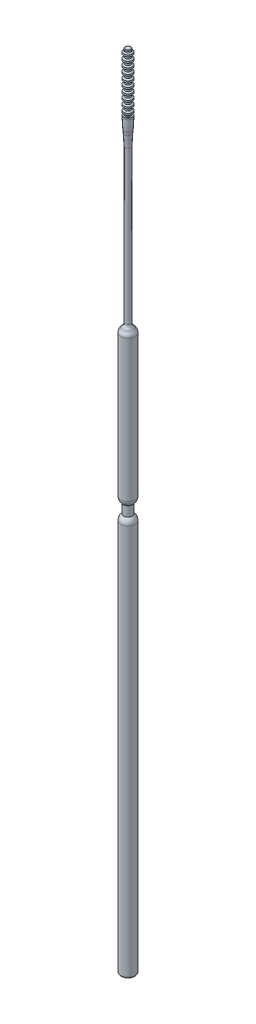
ISO-10303-21;
HEADER;
FILE_DESCRIPTION(('STEP AP214'),'2;1');
FILE_NAME('part.step','',(''),(''),'','','');
FILE_SCHEMA(('AUTOMOTIVE_DESIGN { 1 0 10303 214 1 1 1 1 }'));
ENDSEC;
DATA;
#1=APPLICATION_CONTEXT('core data for automotive mechanical design processes');
#2=APPLICATION_PROTOCOL_DEFINITION('international standard','automotive_design',2000,#1);
#3=PRODUCT_CONTEXT('',#1,'mechanical');
#4=PRODUCT('Part','Part','',(#3));
#5=PRODUCT_RELATED_PRODUCT_CATEGORY('part','',(#4));
#6=PRODUCT_DEFINITION_FORMATION('','',#4);
#7=PRODUCT_DEFINITION_CONTEXT('part definition',#1,'design');
#8=PRODUCT_DEFINITION('design','',#6,#7);
#9=PRODUCT_DEFINITION_SHAPE('','',#8);
#10=(LENGTH_UNIT() NAMED_UNIT(*) SI_UNIT(.MILLI.,.METRE.));
#11=(NAMED_UNIT(*) PLANE_ANGLE_UNIT() SI_UNIT($,.RADIAN.));
#12=(NAMED_UNIT(*) SI_UNIT($,.STERADIAN.) SOLID_ANGLE_UNIT());
#13=UNCERTAINTY_MEASURE_WITH_UNIT(LENGTH_MEASURE(1.E-05),#10,'distance_accuracy_value','');
#14=(GEOMETRIC_REPRESENTATION_CONTEXT(3) GLOBAL_UNCERTAINTY_ASSIGNED_CONTEXT((#13)) GLOBAL_UNIT_ASSIGNED_CONTEXT((#10,
#11,#12)) REPRESENTATION_CONTEXT('',''));
#15=CARTESIAN_POINT('',(0.,0.,0.));
#16=DIRECTION('',(0.,0.,1.));
#17=DIRECTION('',(1.,0.,0.));
#18=AXIS2_PLACEMENT_3D('',#15,#16,#17);
#19=CARTESIAN_POINT('',(0.,11.5,0.));
#20=DIRECTION('',(0.,-1.,0.));
#21=DIRECTION('',(0.,0.,-1.));
#22=AXIS2_PLACEMENT_3D('',#19,#20,#21);
#23=CYLINDRICAL_SURFACE('',#22,0.5);
#24=CARTESIAN_POINT('',(0.,19.1498962308952,0.));
#25=DIRECTION('',(0.,-1.,0.));
#26=DIRECTION('',(1.,0.,0.));
#27=AXIS2_PLACEMENT_3D('',#24,#25,#26);
#28=CIRCLE('',#27,0.5);
#29=CARTESIAN_POINT('',(0.5,19.1498962308952,0.));
#30=VERTEX_POINT('',#29);
#31=EDGE_CURVE('E151',#30,#30,#28,.F.);
#32=ORIENTED_EDGE('',*,*,#31,.T.);
#33=EDGE_LOOP('',(#32));
#34=FACE_BOUND('',#33,.T.);
#35=CARTESIAN_POINT('',(0.,19.8447025837048,0.));
#36=DIRECTION('',(0.,-1.,0.));
#37=DIRECTION('',(1.,0.,0.));
#38=AXIS2_PLACEMENT_3D('',#35,#36,#37);
#39=CIRCLE('',#38,0.5);
#40=CARTESIAN_POINT('',(0.5,19.8447025837048,0.));
#41=VERTEX_POINT('',#40);
#42=EDGE_CURVE('E137',#41,#41,#39,.F.);
#43=ORIENTED_EDGE('',*,*,#42,.F.);
#44=EDGE_LOOP('',(#43));
#45=FACE_BOUND('',#44,.T.);
#46=ADVANCED_FACE('F42',(#34,#45),#23,.T.);
#47=CARTESIAN_POINT('',(0.,18.1498962308952,0.));
#48=DIRECTION('',(0.,-1.,0.));
#49=DIRECTION('',(1.,0.,0.));
#50=AXIS2_PLACEMENT_3D('',#47,#48,#49);
#51=CIRCLE('',#50,0.5);
#52=CARTESIAN_POINT('',(0.5,18.1498962308952,0.));
#53=VERTEX_POINT('',#52);
#54=EDGE_CURVE('E160',#53,#53,#51,.F.);
#55=ORIENTED_EDGE('',*,*,#54,.T.);
#56=EDGE_LOOP('',(#55));
#57=FACE_BOUND('',#56,.T.);
#58=CARTESIAN_POINT('',(0.,18.8447025837048,0.));
#59=DIRECTION('',(0.,-1.,0.));
#60=DIRECTION('',(1.,0.,0.));
#61=AXIS2_PLACEMENT_3D('',#58,#59,#60);
#62=CIRCLE('',#61,0.5);
#63=CARTESIAN_POINT('',(0.5,18.8447025837048,0.));
#64=VERTEX_POINT('',#63);
#65=EDGE_CURVE('E144',#64,#64,#62,.F.);
#66=ORIENTED_EDGE('',*,*,#65,.F.);
#67=EDGE_LOOP('',(#66));
#68=FACE_BOUND('',#67,.T.);
#69=ADVANCED_FACE('F74',(#57,#68),#23,.T.);
#70=CARTESIAN_POINT('',(0.,17.1498962308952,0.));
#71=DIRECTION('',(0.,-1.,0.));
#72=DIRECTION('',(1.,0.,0.));
#73=AXIS2_PLACEMENT_3D('',#70,#71,#72);
#74=CIRCLE('',#73,0.5);
#75=CARTESIAN_POINT('',(0.5,17.1498962308952,0.));
#76=VERTEX_POINT('',#75);
#77=EDGE_CURVE('E170',#76,#76,#74,.F.);
#78=ORIENTED_EDGE('',*,*,#77,.T.);
#79=EDGE_LOOP('',(#78));
#80=FACE_BOUND('',#79,.T.);
#81=CARTESIAN_POINT('',(0.,17.8447025837048,0.));
#82=DIRECTION('',(0.,-1.,0.));
#83=DIRECTION('',(1.,0.,0.));
#84=AXIS2_PLACEMENT_3D('',#81,#82,#83);
#85=CIRCLE('',#84,0.5);
#86=CARTESIAN_POINT('',(0.5,17.8447025837048,0.));
#87=VERTEX_POINT('',#86);
#88=EDGE_CURVE('E159',#87,#87,#85,.F.);
#89=ORIENTED_EDGE('',*,*,#88,.F.);
#90=EDGE_LOOP('',(#89));
#91=FACE_BOUND('',#90,.T.);
#92=ADVANCED_FACE('F79',(#80,#91),#23,.T.);
#93=CARTESIAN_POINT('',(0.,16.1498962308952,0.));
#94=DIRECTION('',(0.,-1.,0.));
#95=DIRECTION('',(1.,0.,0.));
#96=AXIS2_PLACEMENT_3D('',#93,#94,#95);
#97=CIRCLE('',#96,0.5);
#98=CARTESIAN_POINT('',(0.5,16.1498962308952,0.));
#99=VERTEX_POINT('',#98);
#100=EDGE_CURVE('E180',#99,#99,#97,.F.);
#101=ORIENTED_EDGE('',*,*,#100,.T.);
#102=EDGE_LOOP('',(#101));
#103=FACE_BOUND('',#102,.T.);
#104=CARTESIAN_POINT('',(0.,16.8447025837048,0.));
#105=DIRECTION('',(0.,-1.,0.));
#106=DIRECTION('',(1.,0.,0.));
#107=AXIS2_PLACEMENT_3D('',#104,#105,#106);
#108=CIRCLE('',#107,0.5);
#109=CARTESIAN_POINT('',(0.5,16.8447025837048,0.));
#110=VERTEX_POINT('',#109);
#111=EDGE_CURVE('E169',#110,#110,#108,.F.);
#112=ORIENTED_EDGE('',*,*,#111,.F.);
#113=EDGE_LOOP('',(#112));
#114=FACE_BOUND('',#113,.T.);
#115=ADVANCED_FACE('F506',(#103,#114),#23,.T.);
#116=CARTESIAN_POINT('',(0.,15.1498962308952,0.));
#117=DIRECTION('',(0.,-1.,0.));
#118=DIRECTION('',(1.,0.,0.));
#119=AXIS2_PLACEMENT_3D('',#116,#117,#118);
#120=CIRCLE('',#119,0.5);
#121=CARTESIAN_POINT('',(0.5,15.1498962308952,0.));
#122=VERTEX_POINT('',#121);
#123=EDGE_CURVE('E190',#122,#122,#120,.F.);
#124=ORIENTED_EDGE('',*,*,#123,.T.);
#125=EDGE_LOOP('',(#124));
#126=FACE_BOUND('',#125,.T.);
#127=CARTESIAN_POINT('',(0.,15.8447025837048,0.));
#128=DIRECTION('',(0.,-1.,0.));
#129=DIRECTION('',(1.,0.,0.));
#130=AXIS2_PLACEMENT_3D('',#127,#128,#129);
#131=CIRCLE('',#130,0.5);
#132=CARTESIAN_POINT('',(0.5,15.8447025837048,0.));
#133=VERTEX_POINT('',#132);
#134=EDGE_CURVE('E179',#133,#133,#131,.F.);
#135=ORIENTED_EDGE('',*,*,#134,.F.);
#136=EDGE_LOOP('',(#135));
#137=FACE_BOUND('',#136,.T.);
#138=ADVANCED_FACE('F496',(#126,#137),#23,.T.);
#139=CARTESIAN_POINT('',(0.,14.1498962308952,0.));
#140=DIRECTION('',(0.,-1.,0.));
#141=DIRECTION('',(1.,0.,0.));
#142=AXIS2_PLACEMENT_3D('',#139,#140,#141);
#143=CIRCLE('',#142,0.5);
#144=CARTESIAN_POINT('',(0.5,14.1498962308952,0.));
#145=VERTEX_POINT('',#144);
#146=EDGE_CURVE('E200',#145,#145,#143,.F.);
#147=ORIENTED_EDGE('',*,*,#146,.T.);
#148=EDGE_LOOP('',(#147));
#149=FACE_BOUND('',#148,.T.);
#150=CARTESIAN_POINT('',(0.,14.8447025837048,0.));
#151=DIRECTION('',(0.,-1.,0.));
#152=DIRECTION('',(1.,0.,0.));
#153=AXIS2_PLACEMENT_3D('',#150,#151,#152);
#154=CIRCLE('',#153,0.5);
#155=CARTESIAN_POINT('',(0.5,14.8447025837048,0.));
#156=VERTEX_POINT('',#155);
#157=EDGE_CURVE('E189',#156,#156,#154,.F.);
#158=ORIENTED_EDGE('',*,*,#157,.F.);
#159=EDGE_LOOP('',(#158));
#160=FACE_BOUND('',#159,.T.);
#161=ADVANCED_FACE('F491',(#149,#160),#23,.T.);
#162=CARTESIAN_POINT('',(0.,13.1498962308952,0.));
#163=DIRECTION('',(0.,-1.,0.));
#164=DIRECTION('',(1.,0.,0.));
#165=AXIS2_PLACEMENT_3D('',#162,#163,#164);
#166=CIRCLE('',#165,0.5);
#167=CARTESIAN_POINT('',(0.5,13.1498962308952,0.));
#168=VERTEX_POINT('',#167);
#169=EDGE_CURVE('E210',#168,#168,#166,.F.);
#170=ORIENTED_EDGE('',*,*,#169,.T.);
#171=EDGE_LOOP('',(#170));
#172=FACE_BOUND('',#171,.T.);
#173=CARTESIAN_POINT('',(0.,13.8447025837048,0.));
#174=DIRECTION('',(0.,-1.,0.));
#175=DIRECTION('',(1.,0.,0.));
#176=AXIS2_PLACEMENT_3D('',#173,#174,#175);
#177=CIRCLE('',#176,0.5);
#178=CARTESIAN_POINT('',(0.5,13.8447025837048,0.));
#179=VERTEX_POINT('',#178);
#180=EDGE_CURVE('E199',#179,#179,#177,.F.);
#181=ORIENTED_EDGE('',*,*,#180,.F.);
#182=EDGE_LOOP('',(#181));
#183=FACE_BOUND('',#182,.T.);
#184=ADVANCED_FACE('F483',(#172,#183),#23,.T.);
#185=CARTESIAN_POINT('',(0.,12.1498962308952,0.));
#186=DIRECTION('',(0.,-1.,0.));
#187=DIRECTION('',(1.,0.,0.));
#188=AXIS2_PLACEMENT_3D('',#185,#186,#187);
#189=CIRCLE('',#188,0.5);
#190=CARTESIAN_POINT('',(0.5,12.1498962308952,0.));
#191=VERTEX_POINT('',#190);
#192=EDGE_CURVE('E220',#191,#191,#189,.F.);
#193=ORIENTED_EDGE('',*,*,#192,.T.);
#194=EDGE_LOOP('',(#193));
#195=FACE_BOUND('',#194,.T.);
#196=CARTESIAN_POINT('',(0.,12.8447025837048,0.));
#197=DIRECTION('',(0.,-1.,0.));
#198=DIRECTION('',(1.,0.,0.));
#199=AXIS2_PLACEMENT_3D('',#196,#197,#198);
#200=CIRCLE('',#199,0.5);
#201=CARTESIAN_POINT('',(0.5,12.8447025837048,0.));
#202=VERTEX_POINT('',#201);
#203=EDGE_CURVE('E209',#202,#202,#200,.F.);
#204=ORIENTED_EDGE('',*,*,#203,.F.);
#205=EDGE_LOOP('',(#204));
#206=FACE_BOUND('',#205,.T.);
#207=ADVANCED_FACE('F479',(#195,#206),#23,.T.);
#208=CARTESIAN_POINT('',(0.,11.1498962308952,0.));
#209=DIRECTION('',(0.,-1.,0.));
#210=DIRECTION('',(1.,0.,0.));
#211=AXIS2_PLACEMENT_3D('',#208,#209,#210);
#212=CIRCLE('',#211,0.5);
#213=CARTESIAN_POINT('',(0.5,11.1498962308952,0.));
#214=VERTEX_POINT('',#213);
#215=EDGE_CURVE('E259',#214,#214,#212,.F.);
#216=ORIENTED_EDGE('',*,*,#215,.T.);
#217=EDGE_LOOP('',(#216));
#218=FACE_BOUND('',#217,.T.);
#219=CARTESIAN_POINT('',(0.,11.8447025837048,0.));
#220=DIRECTION('',(0.,-1.,0.));
#221=DIRECTION('',(1.,0.,0.));
#222=AXIS2_PLACEMENT_3D('',#219,#220,#221);
#223=CIRCLE('',#222,0.5);
#224=CARTESIAN_POINT('',(0.5,11.8447025837048,0.));
#225=VERTEX_POINT('',#224);
#226=EDGE_CURVE('E219',#225,#225,#223,.F.);
#227=ORIENTED_EDGE('',*,*,#226,.F.);
#228=EDGE_LOOP('',(#227));
#229=FACE_BOUND('',#228,.T.);
#230=ADVANCED_FACE('F482',(#218,#229),#23,.T.);
#231=CARTESIAN_POINT('',(0.,10.25,0.));
#232=DIRECTION('',(0.,1.,0.));
#233=DIRECTION('',(0.,0.,1.));
#234=AXIS2_PLACEMENT_3D('',#231,#232,#233);
#235=CIRCLE('',#234,0.5);
#236=CARTESIAN_POINT('',(0.,10.25,0.5));
#237=VERTEX_POINT('',#236);
#238=EDGE_CURVE('E260',#237,#237,#235,.T.);
#239=ORIENTED_EDGE('',*,*,#238,.T.);
#240=EDGE_LOOP('',(#239));
#241=FACE_BOUND('',#240,.T.);
#242=CARTESIAN_POINT('',(0.,10.8447025837048,0.));
#243=DIRECTION('',(0.,-1.,0.));
#244=DIRECTION('',(1.,0.,0.));
#245=AXIS2_PLACEMENT_3D('',#242,#243,#244);
#246=CIRCLE('',#245,0.5);
#247=CARTESIAN_POINT('',(0.5,10.8447025837048,0.));
#248=VERTEX_POINT('',#247);
#249=EDGE_CURVE('E253',#248,#248,#246,.F.);
#250=ORIENTED_EDGE('',*,*,#249,.F.);
#251=EDGE_LOOP('',(#250));
#252=FACE_BOUND('',#251,.T.);
#253=ADVANCED_FACE('F66',(#241,#252),#23,.T.);
#254=CARTESIAN_POINT('',(0.,5.,0.));
#255=DIRECTION('',(0.,-1.,0.));
#256=DIRECTION('',(0.,0.,-1.));
#257=AXIS2_PLACEMENT_3D('',#254,#255,#256);
#258=CYLINDRICAL_SURFACE('',#257,0.5);
#259=CARTESIAN_POINT('',(0.,-21.5857864376269,0.));
#260=DIRECTION('',(0.,1.,0.));
#261=DIRECTION('',(0.,0.,1.));
#262=AXIS2_PLACEMENT_3D('',#259,#260,#261);
#263=CIRCLE('',#262,0.5);
#264=CARTESIAN_POINT('',(0.,-21.5857864376269,0.5));
#265=VERTEX_POINT('',#264);
#266=EDGE_CURVE('E241',#265,#265,#263,.T.);
#267=ORIENTED_EDGE('',*,*,#266,.T.);
#268=EDGE_LOOP('',(#267));
#269=FACE_BOUND('',#268,.T.);
#270=CARTESIAN_POINT('',(0.,5.50248757758217,0.));
#271=DIRECTION('',(0.,-1.,0.));
#272=DIRECTION('',(0.,0.,-1.));
#273=AXIS2_PLACEMENT_3D('',#270,#271,#272);
#274=CIRCLE('',#273,0.5);
#275=CARTESIAN_POINT('',(0.,5.50248757758217,-0.5));
#276=VERTEX_POINT('',#275);
#277=EDGE_CURVE('E258',#276,#276,#274,.T.);
#278=ORIENTED_EDGE('',*,*,#277,.T.);
#279=EDGE_LOOP('',(#278));
#280=FACE_BOUND('',#279,.T.);
#281=ADVANCED_FACE('F95',(#269,#280),#258,.T.);
#282=CARTESIAN_POINT('',(0.,6.5,0.));
#283=DIRECTION('',(0.,1.,0.));
#284=DIRECTION('',(0.,0.,1.));
#285=AXIS2_PLACEMENT_3D('',#282,#283,#284);
#286=CONICAL_SURFACE('',#285,0.5,0.0996686524911621);
#287=CARTESIAN_POINT('',(0.,7.49256195800216,0.));
#288=DIRECTION('',(0.,-1.,0.));
#289=DIRECTION('',(0.,0.,-1.));
#290=AXIS2_PLACEMENT_3D('',#287,#288,#289);
#291=CIRCLE('',#290,0.599256195800215);
#292=CARTESIAN_POINT('',(0.,7.49256195800216,-0.599256195800215));
#293=VERTEX_POINT('',#292);
#294=EDGE_CURVE('E275',#293,#293,#291,.F.);
#295=ORIENTED_EDGE('',*,*,#294,.T.);
#296=EDGE_LOOP('',(#295));
#297=FACE_BOUND('',#296,.T.);
#298=CARTESIAN_POINT('',(0.,8.00743804199785,0.));
#299=DIRECTION('',(0.,-1.,0.));
#300=DIRECTION('',(0.,0.,-1.));
#301=AXIS2_PLACEMENT_3D('',#298,#299,#300);
#302=CIRCLE('',#301,0.650743804199785);
#303=CARTESIAN_POINT('',(0.,8.00743804199785,-0.650743804199785));
#304=VERTEX_POINT('',#303);
#305=EDGE_CURVE('E279',#304,#304,#302,.T.);
#306=ORIENTED_EDGE('',*,*,#305,.T.);
#307=EDGE_LOOP('',(#306));
#308=FACE_BOUND('',#307,.T.);
#309=ADVANCED_FACE('F91',(#297,#308),#286,.T.);
#310=CARTESIAN_POINT('',(0.,5.,0.));
#311=DIRECTION('',(0.,-1.,0.));
#312=DIRECTION('',(0.,0.,-1.));
#313=AXIS2_PLACEMENT_3D('',#310,#311,#312);
#314=CYLINDRICAL_SURFACE('',#313,0.75);
#315=CARTESIAN_POINT('',(0.,9.99751242241783,0.));
#316=DIRECTION('',(0.,1.,0.));
#317=DIRECTION('',(0.,0.,1.));
#318=AXIS2_PLACEMENT_3D('',#315,#316,#317);
#319=CIRCLE('',#318,0.75);
#320=CARTESIAN_POINT('',(0.,9.99751242241783,0.75));
#321=VERTEX_POINT('',#320);
#322=EDGE_CURVE('E264',#321,#321,#319,.T.);
#323=ORIENTED_EDGE('',*,*,#322,.T.);
#324=EDGE_LOOP('',(#323));
#325=FACE_BOUND('',#324,.T.);
#326=CARTESIAN_POINT('',(0.,10.25,0.));
#327=DIRECTION('',(0.,1.,0.));
#328=DIRECTION('',(0.,0.,1.));
#329=AXIS2_PLACEMENT_3D('',#326,#327,#328);
#330=CIRCLE('',#329,0.75);
#331=CARTESIAN_POINT('',(0.,10.25,0.75));
#332=VERTEX_POINT('',#331);
#333=EDGE_CURVE('E254',#332,#332,#330,.F.);
#334=ORIENTED_EDGE('',*,*,#333,.T.);
#335=EDGE_LOOP('',(#334));
#336=FACE_BOUND('',#335,.T.);
#337=ADVANCED_FACE('F87',(#325,#336),#314,.T.);
#338=CARTESIAN_POINT('',(0.,10.25,0.));
#339=DIRECTION('',(0.,1.,0.));
#340=DIRECTION('',(0.,0.,1.));
#341=AXIS2_PLACEMENT_3D('',#338,#339,#340);
#342=PLANE('',#341);
#343=ORIENTED_EDGE('',*,*,#238,.F.);
#344=EDGE_LOOP('',(#343));
#345=FACE_BOUND('',#344,.T.);
#346=ORIENTED_EDGE('',*,*,#333,.F.);
#347=EDGE_LOOP('',(#346));
#348=FACE_BOUND('',#347,.T.);
#349=ADVANCED_FACE('F90',(#345,#348),#342,.T.);
#350=CARTESIAN_POINT('',(0.,5.50248757758217,0.));
#351=DIRECTION('',(0.,-1.,0.));
#352=DIRECTION('',(0.,0.,-1.));
#353=AXIS2_PLACEMENT_3D('',#350,#351,#352);
#354=TOROIDAL_SURFACE('',#353,20.5,20.);
#355=ORIENTED_EDGE('',*,*,#294,.F.);
#356=EDGE_LOOP('',(#355));
#357=FACE_BOUND('',#356,.T.);
#358=ORIENTED_EDGE('',*,*,#277,.F.);
#359=EDGE_LOOP('',(#358));
#360=FACE_BOUND('',#359,.T.);
#361=ADVANCED_FACE('F100',(#357,#360),#354,.F.);
#362=CARTESIAN_POINT('',(0.,9.99751242241783,0.));
#363=DIRECTION('',(0.,1.,0.));
#364=DIRECTION('',(0.,0.,1.));
#365=AXIS2_PLACEMENT_3D('',#362,#363,#364);
#366=DEGENERATE_TOROIDAL_SURFACE('',#365,19.25,20.,.F.);
#367=ORIENTED_EDGE('',*,*,#322,.F.);
#368=EDGE_LOOP('',(#367));
#369=FACE_BOUND('',#368,.T.);
#370=ORIENTED_EDGE('',*,*,#305,.F.);
#371=EDGE_LOOP('',(#370));
#372=FACE_BOUND('',#371,.T.);
#373=ADVANCED_FACE('F103',(#369,#372),#366,.F.);
#374=CARTESIAN_POINT('',(0.,11.5,0.));
#375=DIRECTION('',(0.,-1.,0.));
#376=DIRECTION('',(1.,0.,0.));
#377=AXIS2_PLACEMENT_3D('',#374,#375,#376);
#378=CONICAL_SURFACE('',#377,0.,0.959931088596889);
#379=CARTESIAN_POINT('',(0.,10.9748443463427,0.));
#380=DIRECTION('',(0.,1.,0.));
#381=DIRECTION('',(-1.,0.,0.));
#382=AXIS2_PLACEMENT_3D('',#379,#380,#381);
#383=CIRCLE('',#382,0.750000000000001);
#384=CARTESIAN_POINT('',(-0.75,10.9748443463427,0.));
#385=VERTEX_POINT('',#384);
#386=EDGE_CURVE('E289',#385,#385,#383,.T.);
#387=ORIENTED_EDGE('',*,*,#386,.T.);
#388=EDGE_LOOP('',(#387));
#389=FACE_BOUND('',#388,.T.);
#390=ORIENTED_EDGE('',*,*,#215,.F.);
#391=EDGE_LOOP('',(#390));
#392=FACE_BOUND('',#391,.T.);
#393=ADVANCED_FACE('F85',(#389,#392),#378,.T.);
#394=CARTESIAN_POINT('',(0.,11.1948063528096,0.));
#395=DIRECTION('',(0.,-1.,0.));
#396=DIRECTION('',(1.,0.,0.));
#397=AXIS2_PLACEMENT_3D('',#394,#395,#396);
#398=CONICAL_SURFACE('',#397,0.,0.959931088596887);
#399=CARTESIAN_POINT('',(0.,10.6696506991524,0.));
#400=DIRECTION('',(0.,1.,0.));
#401=DIRECTION('',(-1.,0.,0.));
#402=AXIS2_PLACEMENT_3D('',#399,#400,#401);
#403=CIRCLE('',#402,0.75);
#404=CARTESIAN_POINT('',(-0.75,10.6696506991524,0.));
#405=VERTEX_POINT('',#404);
#406=EDGE_CURVE('E268',#405,#405,#403,.T.);
#407=ORIENTED_EDGE('',*,*,#406,.F.);
#408=EDGE_LOOP('',(#407));
#409=FACE_BOUND('',#408,.T.);
#410=ORIENTED_EDGE('',*,*,#249,.T.);
#411=EDGE_LOOP('',(#410));
#412=FACE_BOUND('',#411,.T.);
#413=ADVANCED_FACE('F680',(#409,#412),#398,.F.);
#414=CARTESIAN_POINT('',(0.,11.5,0.));
#415=DIRECTION('',(0.,1.,0.));
#416=DIRECTION('',(-1.,0.,0.));
#417=AXIS2_PLACEMENT_3D('',#414,#415,#416);
#418=CYLINDRICAL_SURFACE('',#417,0.75);
#419=ORIENTED_EDGE('',*,*,#386,.F.);
#420=EDGE_LOOP('',(#419));
#421=FACE_BOUND('',#420,.T.);
#422=ORIENTED_EDGE('',*,*,#406,.T.);
#423=EDGE_LOOP('',(#422));
#424=FACE_BOUND('',#423,.T.);
#425=ADVANCED_FACE('F586',(#421,#424),#418,.T.);
#426=CARTESIAN_POINT('',(0.,-21.5,0.));
#427=DIRECTION('',(0.,1.,0.));
#428=DIRECTION('',(0.,0.,1.));
#429=AXIS2_PLACEMENT_3D('',#426,#427,#428);
#430=CYLINDRICAL_SURFACE('',#429,1.25);
#431=CARTESIAN_POINT('',(0.,-23.1642135623731,0.));
#432=DIRECTION('',(0.,-1.,0.));
#433=DIRECTION('',(0.,0.,-1.));
#434=AXIS2_PLACEMENT_3D('',#431,#432,#433);
#435=CIRCLE('',#434,1.25);
#436=CARTESIAN_POINT('',(0.,-23.1642135623731,-1.25));
#437=VERTEX_POINT('',#436);
#438=EDGE_CURVE('E229',#437,#437,#435,.T.);
#439=ORIENTED_EDGE('',*,*,#438,.T.);
#440=EDGE_LOOP('',(#439));
#441=FACE_BOUND('',#440,.T.);
#442=CARTESIAN_POINT('',(0.,-48.25,0.));
#443=DIRECTION('',(0.,1.,0.));
#444=DIRECTION('',(0.,0.,1.));
#445=AXIS2_PLACEMENT_3D('',#442,#443,#444);
#446=CIRCLE('',#445,1.25);
#447=CARTESIAN_POINT('',(0.,-48.25,1.25));
#448=VERTEX_POINT('',#447);
#449=EDGE_CURVE('E293',#448,#448,#446,.T.);
#450=ORIENTED_EDGE('',*,*,#449,.T.);
#451=EDGE_LOOP('',(#450));
#452=FACE_BOUND('',#451,.T.);
#453=ADVANCED_FACE('F580',(#441,#452),#430,.T.);
#454=CARTESIAN_POINT('',(0.,-48.25,0.));
#455=DIRECTION('',(0.,1.,0.));
#456=DIRECTION('',(-1.,0.,0.));
#457=AXIS2_PLACEMENT_3D('',#454,#455,#456);
#458=SPHERICAL_SURFACE('',#457,1.25);
#459=CARTESIAN_POINT('',(0.,-49.25,0.));
#460=DIRECTION('',(0.,1.,0.));
#461=DIRECTION('',(0.,0.,1.));
#462=AXIS2_PLACEMENT_3D('',#459,#460,#461);
#463=CIRCLE('',#462,0.75);
#464=CARTESIAN_POINT('',(0.,-49.25,0.75));
#465=VERTEX_POINT('',#464);
#466=EDGE_CURVE('E297',#465,#465,#463,.T.);
#467=ORIENTED_EDGE('',*,*,#466,.T.);
#468=EDGE_LOOP('',(#467));
#469=FACE_BOUND('',#468,.T.);
#470=ORIENTED_EDGE('',*,*,#449,.F.);
#471=EDGE_LOOP('',(#470));
#472=FACE_BOUND('',#471,.T.);
#473=ADVANCED_FACE('F585',(#469,#472),#458,.T.);
#474=CARTESIAN_POINT('',(0.,-21.5,0.));
#475=DIRECTION('',(0.,1.,0.));
#476=DIRECTION('',(0.,0.,1.));
#477=AXIS2_PLACEMENT_3D('',#474,#475,#476);
#478=CYLINDRICAL_SURFACE('',#477,0.75);
#479=CARTESIAN_POINT('',(0.,-51.,0.));
#480=DIRECTION('',(0.,1.,0.));
#481=DIRECTION('',(0.,0.,1.));
#482=AXIS2_PLACEMENT_3D('',#479,#480,#481);
#483=CIRCLE('',#482,0.75);
#484=CARTESIAN_POINT('',(0.,-51.,0.75));
#485=VERTEX_POINT('',#484);
#486=EDGE_CURVE('E301',#485,#485,#483,.T.);
#487=ORIENTED_EDGE('',*,*,#486,.T.);
#488=EDGE_LOOP('',(#487));
#489=FACE_BOUND('',#488,.T.);
#490=ORIENTED_EDGE('',*,*,#466,.F.);
#491=EDGE_LOOP('',(#490));
#492=FACE_BOUND('',#491,.T.);
#493=ADVANCED_FACE('F632',(#489,#492),#478,.T.);
#494=CARTESIAN_POINT('',(0.,-52.,0.));
#495=DIRECTION('',(0.,1.,0.));
#496=DIRECTION('',(-1.,0.,0.));
#497=AXIS2_PLACEMENT_3D('',#494,#495,#496);
#498=SPHERICAL_SURFACE('',#497,1.25);
#499=CARTESIAN_POINT('',(0.,-52.,0.));
#500=DIRECTION('',(0.,1.,0.));
#501=DIRECTION('',(0.,0.,1.));
#502=AXIS2_PLACEMENT_3D('',#499,#500,#501);
#503=CIRCLE('',#502,1.25);
#504=CARTESIAN_POINT('',(0.,-52.,1.25));
#505=VERTEX_POINT('',#504);
#506=EDGE_CURVE('E224',#505,#505,#503,.T.);
#507=ORIENTED_EDGE('',*,*,#506,.T.);
#508=EDGE_LOOP('',(#507));
#509=FACE_BOUND('',#508,.T.);
#510=ORIENTED_EDGE('',*,*,#486,.F.);
#511=EDGE_LOOP('',(#510));
#512=FACE_BOUND('',#511,.T.);
#513=ADVANCED_FACE('F621',(#509,#512),#498,.T.);
#514=CARTESIAN_POINT('',(0.,-21.5,0.));
#515=DIRECTION('',(0.,1.,0.));
#516=DIRECTION('',(0.,0.,1.));
#517=AXIS2_PLACEMENT_3D('',#514,#515,#516);
#518=CYLINDRICAL_SURFACE('',#517,1.24999999999999);
#519=CARTESIAN_POINT('',(0.,-121.25,0.));
#520=DIRECTION('',(0.,1.,0.));
#521=DIRECTION('',(0.,0.,1.));
#522=AXIS2_PLACEMENT_3D('',#519,#520,#521);
#523=CIRCLE('',#522,1.24999999999999);
#524=CARTESIAN_POINT('',(0.,-121.25,1.24999999999999));
#525=VERTEX_POINT('',#524);
#526=EDGE_CURVE('E249',#525,#525,#523,.T.);
#527=ORIENTED_EDGE('',*,*,#526,.T.);
#528=EDGE_LOOP('',(#527));
#529=FACE_BOUND('',#528,.T.);
#530=ORIENTED_EDGE('',*,*,#506,.F.);
#531=EDGE_LOOP('',(#530));
#532=FACE_BOUND('',#531,.T.);
#533=ADVANCED_FACE('F611',(#529,#532),#518,.T.);
#534=CARTESIAN_POINT('',(0.,-121.5,0.));
#535=DIRECTION('',(0.,1.,0.));
#536=DIRECTION('',(0.,0.,1.));
#537=AXIS2_PLACEMENT_3D('',#534,#535,#536);
#538=PLANE('',#537);
#539=CARTESIAN_POINT('',(0.,-121.5,0.));
#540=DIRECTION('',(0.,1.,0.));
#541=DIRECTION('',(0.,0.,1.));
#542=AXIS2_PLACEMENT_3D('',#539,#540,#541);
#543=CIRCLE('',#542,0.999999999999992);
#544=CARTESIAN_POINT('',(0.,-121.5,0.999999999999992));
#545=VERTEX_POINT('',#544);
#546=EDGE_CURVE('E245',#545,#545,#543,.F.);
#547=ORIENTED_EDGE('',*,*,#546,.T.);
#548=EDGE_LOOP('',(#547));
#549=FACE_BOUND('',#548,.T.);
#550=ADVANCED_FACE('F573',(#549),#538,.F.);
#551=CARTESIAN_POINT('',(0.,-22.,0.));
#552=DIRECTION('',(0.,-1.,0.));
#553=DIRECTION('',(0.,0.,-1.));
#554=AXIS2_PLACEMENT_3D('',#551,#552,#553);
#555=CONICAL_SURFACE('',#554,0.5,0.785398163397448);
#556=CARTESIAN_POINT('',(0.,-22.2928932188135,0.));
#557=DIRECTION('',(0.,1.,0.));
#558=DIRECTION('',(0.,0.,1.));
#559=AXIS2_PLACEMENT_3D('',#556,#557,#558);
#560=CIRCLE('',#559,0.792893218813451);
#561=CARTESIAN_POINT('',(0.,-22.2928932188135,0.792893218813451));
#562=VERTEX_POINT('',#561);
#563=EDGE_CURVE('E233',#562,#562,#560,.F.);
#564=ORIENTED_EDGE('',*,*,#563,.T.);
#565=EDGE_LOOP('',(#564));
#566=FACE_BOUND('',#565,.T.);
#567=CARTESIAN_POINT('',(0.,-22.4571067811865,0.));
#568=DIRECTION('',(0.,1.,0.));
#569=DIRECTION('',(0.,0.,1.));
#570=AXIS2_PLACEMENT_3D('',#567,#568,#569);
#571=CIRCLE('',#570,0.957106781186547);
#572=CARTESIAN_POINT('',(0.,-22.4571067811865,0.957106781186547));
#573=VERTEX_POINT('',#572);
#574=EDGE_CURVE('E237',#573,#573,#571,.T.);
#575=ORIENTED_EDGE('',*,*,#574,.T.);
#576=EDGE_LOOP('',(#575));
#577=FACE_BOUND('',#576,.T.);
#578=ADVANCED_FACE('F115',(#566,#577),#555,.T.);
#579=CARTESIAN_POINT('',(0.,-121.25,0.));
#580=DIRECTION('',(0.,1.,0.));
#581=DIRECTION('',(0.,0.,1.));
#582=AXIS2_PLACEMENT_3D('',#579,#580,#581);
#583=TOROIDAL_SURFACE('',#582,0.999999999999992,0.25);
#584=ORIENTED_EDGE('',*,*,#546,.F.);
#585=EDGE_LOOP('',(#584));
#586=FACE_BOUND('',#585,.T.);
#587=ORIENTED_EDGE('',*,*,#526,.F.);
#588=EDGE_LOOP('',(#587));
#589=FACE_BOUND('',#588,.T.);
#590=ADVANCED_FACE('F111',(#586,#589),#583,.T.);
#591=CARTESIAN_POINT('',(0.,-21.5857864376269,0.));
#592=DIRECTION('',(0.,1.,0.));
#593=DIRECTION('',(0.,0.,1.));
#594=AXIS2_PLACEMENT_3D('',#591,#592,#593);
#595=TOROIDAL_SURFACE('',#594,1.5,1.);
#596=ORIENTED_EDGE('',*,*,#563,.F.);
#597=EDGE_LOOP('',(#596));
#598=FACE_BOUND('',#597,.T.);
#599=ORIENTED_EDGE('',*,*,#266,.F.);
#600=EDGE_LOOP('',(#599));
#601=FACE_BOUND('',#600,.T.);
#602=ADVANCED_FACE('F114',(#598,#601),#595,.F.);
#603=CARTESIAN_POINT('',(0.,-23.1642135623731,0.));
#604=DIRECTION('',(0.,-1.,0.));
#605=DIRECTION('',(0.,0.,-1.));
#606=AXIS2_PLACEMENT_3D('',#603,#604,#605);
#607=DEGENERATE_TOROIDAL_SURFACE('',#606,0.249999999999998,1.,.T.);
#608=ORIENTED_EDGE('',*,*,#438,.F.);
#609=EDGE_LOOP('',(#608));
#610=FACE_BOUND('',#609,.T.);
#611=ORIENTED_EDGE('',*,*,#574,.F.);
#612=EDGE_LOOP('',(#611));
#613=FACE_BOUND('',#612,.T.);
#614=ADVANCED_FACE('F119',(#610,#613),#607,.T.);
#615=CARTESIAN_POINT('',(0.,12.5,0.));
#616=DIRECTION('',(0.,-1.,0.));
#617=DIRECTION('',(1.,0.,0.));
#618=AXIS2_PLACEMENT_3D('',#615,#616,#617);
#619=CONICAL_SURFACE('',#618,0.,0.959931088596889);
#620=CARTESIAN_POINT('',(0.,11.9748443463427,0.));
#621=DIRECTION('',(0.,1.,0.));
#622=DIRECTION('',(-1.,0.,0.));
#623=AXIS2_PLACEMENT_3D('',#620,#621,#622);
#624=CIRCLE('',#623,0.750000000000001);
#625=CARTESIAN_POINT('',(-0.75,11.9748443463427,0.));
#626=VERTEX_POINT('',#625);
#627=EDGE_CURVE('E214',#626,#626,#624,.T.);
#628=ORIENTED_EDGE('',*,*,#627,.T.);
#629=EDGE_LOOP('',(#628));
#630=FACE_BOUND('',#629,.T.);
#631=ORIENTED_EDGE('',*,*,#192,.F.);
#632=EDGE_LOOP('',(#631));
#633=FACE_BOUND('',#632,.T.);
#634=ADVANCED_FACE('F122',(#630,#633),#619,.T.);
#635=CARTESIAN_POINT('',(0.,12.1948063528096,0.));
#636=DIRECTION('',(0.,-1.,0.));
#637=DIRECTION('',(1.,0.,0.));
#638=AXIS2_PLACEMENT_3D('',#635,#636,#637);
#639=CONICAL_SURFACE('',#638,0.,0.959931088596887);
#640=CARTESIAN_POINT('',(0.,11.6696506991524,0.));
#641=DIRECTION('',(0.,1.,0.));
#642=DIRECTION('',(-1.,0.,0.));
#643=AXIS2_PLACEMENT_3D('',#640,#641,#642);
#644=CIRCLE('',#643,0.75);
#645=CARTESIAN_POINT('',(-0.75,11.6696506991524,0.));
#646=VERTEX_POINT('',#645);
#647=EDGE_CURVE('E225',#646,#646,#644,.T.);
#648=ORIENTED_EDGE('',*,*,#647,.F.);
#649=EDGE_LOOP('',(#648));
#650=FACE_BOUND('',#649,.T.);
#651=ORIENTED_EDGE('',*,*,#226,.T.);
#652=EDGE_LOOP('',(#651));
#653=FACE_BOUND('',#652,.T.);
#654=ADVANCED_FACE('F467',(#650,#653),#639,.F.);
#655=CARTESIAN_POINT('',(0.,12.5,0.));
#656=DIRECTION('',(0.,1.,0.));
#657=DIRECTION('',(-1.,0.,0.));
#658=AXIS2_PLACEMENT_3D('',#655,#656,#657);
#659=CYLINDRICAL_SURFACE('',#658,0.75);
#660=ORIENTED_EDGE('',*,*,#627,.F.);
#661=EDGE_LOOP('',(#660));
#662=FACE_BOUND('',#661,.T.);
#663=ORIENTED_EDGE('',*,*,#647,.T.);
#664=EDGE_LOOP('',(#663));
#665=FACE_BOUND('',#664,.T.);
#666=ADVANCED_FACE('F463',(#662,#665),#659,.T.);
#667=CARTESIAN_POINT('',(0.,13.5,0.));
#668=DIRECTION('',(0.,-1.,0.));
#669=DIRECTION('',(1.,0.,0.));
#670=AXIS2_PLACEMENT_3D('',#667,#668,#669);
#671=CONICAL_SURFACE('',#670,0.,0.959931088596889);
#672=CARTESIAN_POINT('',(0.,12.9748443463427,0.));
#673=DIRECTION('',(0.,1.,0.));
#674=DIRECTION('',(-1.,0.,0.));
#675=AXIS2_PLACEMENT_3D('',#672,#673,#674);
#676=CIRCLE('',#675,0.750000000000001);
#677=CARTESIAN_POINT('',(-0.75,12.9748443463427,0.));
#678=VERTEX_POINT('',#677);
#679=EDGE_CURVE('E204',#678,#678,#676,.T.);
#680=ORIENTED_EDGE('',*,*,#679,.T.);
#681=EDGE_LOOP('',(#680));
#682=FACE_BOUND('',#681,.T.);
#683=ORIENTED_EDGE('',*,*,#169,.F.);
#684=EDGE_LOOP('',(#683));
#685=FACE_BOUND('',#684,.T.);
#686=ADVANCED_FACE('F459',(#682,#685),#671,.T.);
#687=CARTESIAN_POINT('',(0.,13.1948063528096,0.));
#688=DIRECTION('',(0.,-1.,0.));
#689=DIRECTION('',(1.,0.,0.));
#690=AXIS2_PLACEMENT_3D('',#687,#688,#689);
#691=CONICAL_SURFACE('',#690,0.,0.959931088596887);
#692=CARTESIAN_POINT('',(0.,12.6696506991524,0.));
#693=DIRECTION('',(0.,1.,0.));
#694=DIRECTION('',(-1.,0.,0.));
#695=AXIS2_PLACEMENT_3D('',#692,#693,#694);
#696=CIRCLE('',#695,0.75);
#697=CARTESIAN_POINT('',(-0.75,12.6696506991524,0.));
#698=VERTEX_POINT('',#697);
#699=EDGE_CURVE('E215',#698,#698,#696,.T.);
#700=ORIENTED_EDGE('',*,*,#699,.F.);
#701=EDGE_LOOP('',(#700));
#702=FACE_BOUND('',#701,.T.);
#703=ORIENTED_EDGE('',*,*,#203,.T.);
#704=EDGE_LOOP('',(#703));
#705=FACE_BOUND('',#704,.T.);
#706=ADVANCED_FACE('F455',(#702,#705),#691,.F.);
#707=CARTESIAN_POINT('',(0.,13.5,0.));
#708=DIRECTION('',(0.,1.,0.));
#709=DIRECTION('',(-1.,0.,0.));
#710=AXIS2_PLACEMENT_3D('',#707,#708,#709);
#711=CYLINDRICAL_SURFACE('',#710,0.75);
#712=ORIENTED_EDGE('',*,*,#679,.F.);
#713=EDGE_LOOP('',(#712));
#714=FACE_BOUND('',#713,.T.);
#715=ORIENTED_EDGE('',*,*,#699,.T.);
#716=EDGE_LOOP('',(#715));
#717=FACE_BOUND('',#716,.T.);
#718=ADVANCED_FACE('F451',(#714,#717),#711,.T.);
#719=CARTESIAN_POINT('',(0.,14.5,0.));
#720=DIRECTION('',(0.,-1.,0.));
#721=DIRECTION('',(1.,0.,0.));
#722=AXIS2_PLACEMENT_3D('',#719,#720,#721);
#723=CONICAL_SURFACE('',#722,0.,0.959931088596889);
#724=CARTESIAN_POINT('',(0.,13.9748443463427,0.));
#725=DIRECTION('',(0.,1.,0.));
#726=DIRECTION('',(-1.,0.,0.));
#727=AXIS2_PLACEMENT_3D('',#724,#725,#726);
#728=CIRCLE('',#727,0.750000000000001);
#729=CARTESIAN_POINT('',(-0.75,13.9748443463427,0.));
#730=VERTEX_POINT('',#729);
#731=EDGE_CURVE('E194',#730,#730,#728,.T.);
#732=ORIENTED_EDGE('',*,*,#731,.T.);
#733=EDGE_LOOP('',(#732));
#734=FACE_BOUND('',#733,.T.);
#735=ORIENTED_EDGE('',*,*,#146,.F.);
#736=EDGE_LOOP('',(#735));
#737=FACE_BOUND('',#736,.T.);
#738=ADVANCED_FACE('F447',(#734,#737),#723,.T.);
#739=CARTESIAN_POINT('',(0.,14.1948063528096,0.));
#740=DIRECTION('',(0.,-1.,0.));
#741=DIRECTION('',(1.,0.,0.));
#742=AXIS2_PLACEMENT_3D('',#739,#740,#741);
#743=CONICAL_SURFACE('',#742,0.,0.959931088596887);
#744=CARTESIAN_POINT('',(0.,13.6696506991524,0.));
#745=DIRECTION('',(0.,1.,0.));
#746=DIRECTION('',(-1.,0.,0.));
#747=AXIS2_PLACEMENT_3D('',#744,#745,#746);
#748=CIRCLE('',#747,0.75);
#749=CARTESIAN_POINT('',(-0.75,13.6696506991524,0.));
#750=VERTEX_POINT('',#749);
#751=EDGE_CURVE('E205',#750,#750,#748,.T.);
#752=ORIENTED_EDGE('',*,*,#751,.F.);
#753=EDGE_LOOP('',(#752));
#754=FACE_BOUND('',#753,.T.);
#755=ORIENTED_EDGE('',*,*,#180,.T.);
#756=EDGE_LOOP('',(#755));
#757=FACE_BOUND('',#756,.T.);
#758=ADVANCED_FACE('F443',(#754,#757),#743,.F.);
#759=CARTESIAN_POINT('',(0.,14.5,0.));
#760=DIRECTION('',(0.,1.,0.));
#761=DIRECTION('',(-1.,0.,0.));
#762=AXIS2_PLACEMENT_3D('',#759,#760,#761);
#763=CYLINDRICAL_SURFACE('',#762,0.75);
#764=ORIENTED_EDGE('',*,*,#731,.F.);
#765=EDGE_LOOP('',(#764));
#766=FACE_BOUND('',#765,.T.);
#767=ORIENTED_EDGE('',*,*,#751,.T.);
#768=EDGE_LOOP('',(#767));
#769=FACE_BOUND('',#768,.T.);
#770=ADVANCED_FACE('F439',(#766,#769),#763,.T.);
#771=CARTESIAN_POINT('',(0.,15.5,0.));
#772=DIRECTION('',(0.,-1.,0.));
#773=DIRECTION('',(1.,0.,0.));
#774=AXIS2_PLACEMENT_3D('',#771,#772,#773);
#775=CONICAL_SURFACE('',#774,0.,0.959931088596889);
#776=CARTESIAN_POINT('',(0.,14.9748443463427,0.));
#777=DIRECTION('',(0.,1.,0.));
#778=DIRECTION('',(-1.,0.,0.));
#779=AXIS2_PLACEMENT_3D('',#776,#777,#778);
#780=CIRCLE('',#779,0.750000000000001);
#781=CARTESIAN_POINT('',(-0.75,14.9748443463427,0.));
#782=VERTEX_POINT('',#781);
#783=EDGE_CURVE('E184',#782,#782,#780,.T.);
#784=ORIENTED_EDGE('',*,*,#783,.T.);
#785=EDGE_LOOP('',(#784));
#786=FACE_BOUND('',#785,.T.);
#787=ORIENTED_EDGE('',*,*,#123,.F.);
#788=EDGE_LOOP('',(#787));
#789=FACE_BOUND('',#788,.T.);
#790=ADVANCED_FACE('F435',(#786,#789),#775,.T.);
#791=CARTESIAN_POINT('',(0.,15.1948063528096,0.));
#792=DIRECTION('',(0.,-1.,0.));
#793=DIRECTION('',(1.,0.,0.));
#794=AXIS2_PLACEMENT_3D('',#791,#792,#793);
#795=CONICAL_SURFACE('',#794,0.,0.959931088596887);
#796=CARTESIAN_POINT('',(0.,14.6696506991524,0.));
#797=DIRECTION('',(0.,1.,0.));
#798=DIRECTION('',(-1.,0.,0.));
#799=AXIS2_PLACEMENT_3D('',#796,#797,#798);
#800=CIRCLE('',#799,0.75);
#801=CARTESIAN_POINT('',(-0.75,14.6696506991524,0.));
#802=VERTEX_POINT('',#801);
#803=EDGE_CURVE('E195',#802,#802,#800,.T.);
#804=ORIENTED_EDGE('',*,*,#803,.F.);
#805=EDGE_LOOP('',(#804));
#806=FACE_BOUND('',#805,.T.);
#807=ORIENTED_EDGE('',*,*,#157,.T.);
#808=EDGE_LOOP('',(#807));
#809=FACE_BOUND('',#808,.T.);
#810=ADVANCED_FACE('F431',(#806,#809),#795,.F.);
#811=CARTESIAN_POINT('',(0.,15.5,0.));
#812=DIRECTION('',(0.,1.,0.));
#813=DIRECTION('',(-1.,0.,0.));
#814=AXIS2_PLACEMENT_3D('',#811,#812,#813);
#815=CYLINDRICAL_SURFACE('',#814,0.75);
#816=ORIENTED_EDGE('',*,*,#783,.F.);
#817=EDGE_LOOP('',(#816));
#818=FACE_BOUND('',#817,.T.);
#819=ORIENTED_EDGE('',*,*,#803,.T.);
#820=EDGE_LOOP('',(#819));
#821=FACE_BOUND('',#820,.T.);
#822=ADVANCED_FACE('F427',(#818,#821),#815,.T.);
#823=CARTESIAN_POINT('',(0.,16.5,0.));
#824=DIRECTION('',(0.,-1.,0.));
#825=DIRECTION('',(1.,0.,0.));
#826=AXIS2_PLACEMENT_3D('',#823,#824,#825);
#827=CONICAL_SURFACE('',#826,0.,0.959931088596889);
#828=CARTESIAN_POINT('',(0.,15.9748443463427,0.));
#829=DIRECTION('',(0.,1.,0.));
#830=DIRECTION('',(-1.,0.,0.));
#831=AXIS2_PLACEMENT_3D('',#828,#829,#830);
#832=CIRCLE('',#831,0.750000000000001);
#833=CARTESIAN_POINT('',(-0.75,15.9748443463427,0.));
#834=VERTEX_POINT('',#833);
#835=EDGE_CURVE('E174',#834,#834,#832,.T.);
#836=ORIENTED_EDGE('',*,*,#835,.T.);
#837=EDGE_LOOP('',(#836));
#838=FACE_BOUND('',#837,.T.);
#839=ORIENTED_EDGE('',*,*,#100,.F.);
#840=EDGE_LOOP('',(#839));
#841=FACE_BOUND('',#840,.T.);
#842=ADVANCED_FACE('F423',(#838,#841),#827,.T.);
#843=CARTESIAN_POINT('',(0.,16.1948063528096,0.));
#844=DIRECTION('',(0.,-1.,0.));
#845=DIRECTION('',(1.,0.,0.));
#846=AXIS2_PLACEMENT_3D('',#843,#844,#845);
#847=CONICAL_SURFACE('',#846,0.,0.959931088596887);
#848=CARTESIAN_POINT('',(0.,15.6696506991524,0.));
#849=DIRECTION('',(0.,1.,0.));
#850=DIRECTION('',(-1.,0.,0.));
#851=AXIS2_PLACEMENT_3D('',#848,#849,#850);
#852=CIRCLE('',#851,0.75);
#853=CARTESIAN_POINT('',(-0.75,15.6696506991524,0.));
#854=VERTEX_POINT('',#853);
#855=EDGE_CURVE('E185',#854,#854,#852,.T.);
#856=ORIENTED_EDGE('',*,*,#855,.F.);
#857=EDGE_LOOP('',(#856));
#858=FACE_BOUND('',#857,.T.);
#859=ORIENTED_EDGE('',*,*,#134,.T.);
#860=EDGE_LOOP('',(#859));
#861=FACE_BOUND('',#860,.T.);
#862=ADVANCED_FACE('F419',(#858,#861),#847,.F.);
#863=CARTESIAN_POINT('',(0.,16.5,0.));
#864=DIRECTION('',(0.,1.,0.));
#865=DIRECTION('',(-1.,0.,0.));
#866=AXIS2_PLACEMENT_3D('',#863,#864,#865);
#867=CYLINDRICAL_SURFACE('',#866,0.75);
#868=ORIENTED_EDGE('',*,*,#835,.F.);
#869=EDGE_LOOP('',(#868));
#870=FACE_BOUND('',#869,.T.);
#871=ORIENTED_EDGE('',*,*,#855,.T.);
#872=EDGE_LOOP('',(#871));
#873=FACE_BOUND('',#872,.T.);
#874=ADVANCED_FACE('F415',(#870,#873),#867,.T.);
#875=CARTESIAN_POINT('',(0.,17.5,0.));
#876=DIRECTION('',(0.,-1.,0.));
#877=DIRECTION('',(1.,0.,0.));
#878=AXIS2_PLACEMENT_3D('',#875,#876,#877);
#879=CONICAL_SURFACE('',#878,0.,0.959931088596889);
#880=CARTESIAN_POINT('',(0.,16.9748443463427,0.));
#881=DIRECTION('',(0.,1.,0.));
#882=DIRECTION('',(-1.,0.,0.));
#883=AXIS2_PLACEMENT_3D('',#880,#881,#882);
#884=CIRCLE('',#883,0.750000000000001);
#885=CARTESIAN_POINT('',(-0.75,16.9748443463427,0.));
#886=VERTEX_POINT('',#885);
#887=EDGE_CURVE('E164',#886,#886,#884,.T.);
#888=ORIENTED_EDGE('',*,*,#887,.T.);
#889=EDGE_LOOP('',(#888));
#890=FACE_BOUND('',#889,.T.);
#891=ORIENTED_EDGE('',*,*,#77,.F.);
#892=EDGE_LOOP('',(#891));
#893=FACE_BOUND('',#892,.T.);
#894=ADVANCED_FACE('F411',(#890,#893),#879,.T.);
#895=CARTESIAN_POINT('',(0.,17.1948063528096,0.));
#896=DIRECTION('',(0.,-1.,0.));
#897=DIRECTION('',(1.,0.,0.));
#898=AXIS2_PLACEMENT_3D('',#895,#896,#897);
#899=CONICAL_SURFACE('',#898,0.,0.959931088596887);
#900=CARTESIAN_POINT('',(0.,16.6696506991524,0.));
#901=DIRECTION('',(0.,1.,0.));
#902=DIRECTION('',(-1.,0.,0.));
#903=AXIS2_PLACEMENT_3D('',#900,#901,#902);
#904=CIRCLE('',#903,0.75);
#905=CARTESIAN_POINT('',(-0.75,16.6696506991524,0.));
#906=VERTEX_POINT('',#905);
#907=EDGE_CURVE('E175',#906,#906,#904,.T.);
#908=ORIENTED_EDGE('',*,*,#907,.F.);
#909=EDGE_LOOP('',(#908));
#910=FACE_BOUND('',#909,.T.);
#911=ORIENTED_EDGE('',*,*,#111,.T.);
#912=EDGE_LOOP('',(#911));
#913=FACE_BOUND('',#912,.T.);
#914=ADVANCED_FACE('F407',(#910,#913),#899,.F.);
#915=CARTESIAN_POINT('',(0.,17.5,0.));
#916=DIRECTION('',(0.,1.,0.));
#917=DIRECTION('',(-1.,0.,0.));
#918=AXIS2_PLACEMENT_3D('',#915,#916,#917);
#919=CYLINDRICAL_SURFACE('',#918,0.75);
#920=ORIENTED_EDGE('',*,*,#887,.F.);
#921=EDGE_LOOP('',(#920));
#922=FACE_BOUND('',#921,.T.);
#923=ORIENTED_EDGE('',*,*,#907,.T.);
#924=EDGE_LOOP('',(#923));
#925=FACE_BOUND('',#924,.T.);
#926=ADVANCED_FACE('F403',(#922,#925),#919,.T.);
#927=CARTESIAN_POINT('',(0.,18.5,0.));
#928=DIRECTION('',(0.,-1.,0.));
#929=DIRECTION('',(1.,0.,0.));
#930=AXIS2_PLACEMENT_3D('',#927,#928,#929);
#931=CONICAL_SURFACE('',#930,0.,0.959931088596889);
#932=CARTESIAN_POINT('',(0.,17.9748443463427,0.));
#933=DIRECTION('',(0.,1.,0.));
#934=DIRECTION('',(-1.,0.,0.));
#935=AXIS2_PLACEMENT_3D('',#932,#933,#934);
#936=CIRCLE('',#935,0.750000000000001);
#937=CARTESIAN_POINT('',(-0.75,17.9748443463427,0.));
#938=VERTEX_POINT('',#937);
#939=EDGE_CURVE('E154',#938,#938,#936,.T.);
#940=ORIENTED_EDGE('',*,*,#939,.T.);
#941=EDGE_LOOP('',(#940));
#942=FACE_BOUND('',#941,.T.);
#943=ORIENTED_EDGE('',*,*,#54,.F.);
#944=EDGE_LOOP('',(#943));
#945=FACE_BOUND('',#944,.T.);
#946=ADVANCED_FACE('F399',(#942,#945),#931,.T.);
#947=CARTESIAN_POINT('',(0.,18.1948063528096,0.));
#948=DIRECTION('',(0.,-1.,0.));
#949=DIRECTION('',(1.,0.,0.));
#950=AXIS2_PLACEMENT_3D('',#947,#948,#949);
#951=CONICAL_SURFACE('',#950,0.,0.959931088596887);
#952=CARTESIAN_POINT('',(0.,17.6696506991524,0.));
#953=DIRECTION('',(0.,1.,0.));
#954=DIRECTION('',(-1.,0.,0.));
#955=AXIS2_PLACEMENT_3D('',#952,#953,#954);
#956=CIRCLE('',#955,0.75);
#957=CARTESIAN_POINT('',(-0.75,17.6696506991524,0.));
#958=VERTEX_POINT('',#957);
#959=EDGE_CURVE('E165',#958,#958,#956,.T.);
#960=ORIENTED_EDGE('',*,*,#959,.F.);
#961=EDGE_LOOP('',(#960));
#962=FACE_BOUND('',#961,.T.);
#963=ORIENTED_EDGE('',*,*,#88,.T.);
#964=EDGE_LOOP('',(#963));
#965=FACE_BOUND('',#964,.T.);
#966=ADVANCED_FACE('F395',(#962,#965),#951,.F.);
#967=CARTESIAN_POINT('',(0.,18.5,0.));
#968=DIRECTION('',(0.,1.,0.));
#969=DIRECTION('',(-1.,0.,0.));
#970=AXIS2_PLACEMENT_3D('',#967,#968,#969);
#971=CYLINDRICAL_SURFACE('',#970,0.75);
#972=ORIENTED_EDGE('',*,*,#939,.F.);
#973=EDGE_LOOP('',(#972));
#974=FACE_BOUND('',#973,.T.);
#975=ORIENTED_EDGE('',*,*,#959,.T.);
#976=EDGE_LOOP('',(#975));
#977=FACE_BOUND('',#976,.T.);
#978=ADVANCED_FACE('F391',(#974,#977),#971,.T.);
#979=CARTESIAN_POINT('',(0.,19.5,0.));
#980=DIRECTION('',(0.,-1.,0.));
#981=DIRECTION('',(1.,0.,0.));
#982=AXIS2_PLACEMENT_3D('',#979,#980,#981);
#983=CONICAL_SURFACE('',#982,0.,0.959931088596889);
#984=CARTESIAN_POINT('',(0.,18.9748443463427,0.));
#985=DIRECTION('',(0.,1.,0.));
#986=DIRECTION('',(-1.,0.,0.));
#987=AXIS2_PLACEMENT_3D('',#984,#985,#986);
#988=CIRCLE('',#987,0.750000000000001);
#989=CARTESIAN_POINT('',(-0.75,18.9748443463427,0.));
#990=VERTEX_POINT('',#989);
#991=EDGE_CURVE('E353',#990,#990,#988,.T.);
#992=ORIENTED_EDGE('',*,*,#991,.T.);
#993=EDGE_LOOP('',(#992));
#994=FACE_BOUND('',#993,.T.);
#995=ORIENTED_EDGE('',*,*,#31,.F.);
#996=EDGE_LOOP('',(#995));
#997=FACE_BOUND('',#996,.T.);
#998=ADVANCED_FACE('F387',(#994,#997),#983,.T.);
#999=CARTESIAN_POINT('',(0.,19.1948063528096,0.));
#1000=DIRECTION('',(0.,-1.,0.));
#1001=DIRECTION('',(1.,0.,0.));
#1002=AXIS2_PLACEMENT_3D('',#999,#1000,#1001);
#1003=CONICAL_SURFACE('',#1002,0.,0.959931088596887);
#1004=CARTESIAN_POINT('',(0.,18.6696506991524,0.));
#1005=DIRECTION('',(0.,1.,0.));
#1006=DIRECTION('',(-1.,0.,0.));
#1007=AXIS2_PLACEMENT_3D('',#1004,#1005,#1006);
#1008=CIRCLE('',#1007,0.75);
#1009=CARTESIAN_POINT('',(-0.75,18.6696506991524,0.));
#1010=VERTEX_POINT('',#1009);
#1011=EDGE_CURVE('E155',#1010,#1010,#1008,.T.);
#1012=ORIENTED_EDGE('',*,*,#1011,.F.);
#1013=EDGE_LOOP('',(#1012));
#1014=FACE_BOUND('',#1013,.T.);
#1015=ORIENTED_EDGE('',*,*,#65,.T.);
#1016=EDGE_LOOP('',(#1015));
#1017=FACE_BOUND('',#1016,.T.);
#1018=ADVANCED_FACE('F383',(#1014,#1017),#1003,.F.);
#1019=CARTESIAN_POINT('',(0.,19.5,0.));
#1020=DIRECTION('',(0.,1.,0.));
#1021=DIRECTION('',(-1.,0.,0.));
#1022=AXIS2_PLACEMENT_3D('',#1019,#1020,#1021);
#1023=CYLINDRICAL_SURFACE('',#1022,0.75);
#1024=ORIENTED_EDGE('',*,*,#991,.F.);
#1025=EDGE_LOOP('',(#1024));
#1026=FACE_BOUND('',#1025,.T.);
#1027=ORIENTED_EDGE('',*,*,#1011,.T.);
#1028=EDGE_LOOP('',(#1027));
#1029=FACE_BOUND('',#1028,.T.);
#1030=ADVANCED_FACE('F377',(#1026,#1029),#1023,.T.);
#1031=CARTESIAN_POINT('',(0.,20.5,0.));
#1032=DIRECTION('',(0.,-1.,0.));
#1033=DIRECTION('',(1.,0.,0.));
#1034=AXIS2_PLACEMENT_3D('',#1031,#1032,#1033);
#1035=CONICAL_SURFACE('',#1034,0.,0.959931088596889);
#1036=CARTESIAN_POINT('',(0.,20.1200377315214,0.));
#1037=DIRECTION('',(0.,1.,0.));
#1038=DIRECTION('',(-1.,0.,0.));
#1039=AXIS2_PLACEMENT_3D('',#1036,#1037,#1038);
#1040=CIRCLE('',#1039,0.542642356364894);
#1041=CARTESIAN_POINT('',(-0.542642356364894,20.1200377315214,0.));
#1042=VERTEX_POINT('',#1041);
#1043=EDGE_CURVE('E12',#1042,#1042,#1040,.F.);
#1044=ORIENTED_EDGE('',*,*,#1043,.T.);
#1045=EDGE_LOOP('',(#1044));
#1046=FACE_BOUND('',#1045,.T.);
#1047=CARTESIAN_POINT('',(0.,19.9748443463427,0.));
#1048=DIRECTION('',(0.,1.,0.));
#1049=DIRECTION('',(-1.,0.,0.));
#1050=AXIS2_PLACEMENT_3D('',#1047,#1048,#1049);
#1051=CIRCLE('',#1050,0.750000000000001);
#1052=CARTESIAN_POINT('',(-0.75,19.9748443463427,0.));
#1053=VERTEX_POINT('',#1052);
#1054=EDGE_CURVE('E361',#1053,#1053,#1051,.T.);
#1055=ORIENTED_EDGE('',*,*,#1054,.T.);
#1056=EDGE_LOOP('',(#1055));
#1057=FACE_BOUND('',#1056,.T.);
#1058=ADVANCED_FACE('F366',(#1046,#1057),#1035,.T.);
#1059=CARTESIAN_POINT('',(0.,20.1948063528096,0.));
#1060=DIRECTION('',(0.,-1.,0.));
#1061=DIRECTION('',(1.,0.,0.));
#1062=AXIS2_PLACEMENT_3D('',#1059,#1060,#1061);
#1063=CONICAL_SURFACE('',#1062,0.,0.959931088596887);
#1064=CARTESIAN_POINT('',(0.,19.6696506991524,0.));
#1065=DIRECTION('',(0.,1.,0.));
#1066=DIRECTION('',(-1.,0.,0.));
#1067=AXIS2_PLACEMENT_3D('',#1064,#1065,#1066);
#1068=CIRCLE('',#1067,0.75);
#1069=CARTESIAN_POINT('',(-0.75,19.6696506991524,0.));
#1070=VERTEX_POINT('',#1069);
#1071=EDGE_CURVE('E357',#1070,#1070,#1068,.T.);
#1072=ORIENTED_EDGE('',*,*,#1071,.F.);
#1073=EDGE_LOOP('',(#1072));
#1074=FACE_BOUND('',#1073,.T.);
#1075=ORIENTED_EDGE('',*,*,#42,.T.);
#1076=EDGE_LOOP('',(#1075));
#1077=FACE_BOUND('',#1076,.T.);
#1078=ADVANCED_FACE('F67',(#1074,#1077),#1063,.F.);
#1079=CARTESIAN_POINT('',(0.,20.5,0.));
#1080=DIRECTION('',(0.,1.,0.));
#1081=DIRECTION('',(-1.,0.,0.));
#1082=AXIS2_PLACEMENT_3D('',#1079,#1080,#1081);
#1083=CYLINDRICAL_SURFACE('',#1082,0.75);
#1084=ORIENTED_EDGE('',*,*,#1054,.F.);
#1085=EDGE_LOOP('',(#1084));
#1086=FACE_BOUND('',#1085,.T.);
#1087=ORIENTED_EDGE('',*,*,#1071,.T.);
#1088=EDGE_LOOP('',(#1087));
#1089=FACE_BOUND('',#1088,.T.);
#1090=ADVANCED_FACE('F56',(#1086,#1089),#1083,.T.);
#1091=CARTESIAN_POINT('',(0.,20.5,0.));
#1092=DIRECTION('',(0.,1.,0.));
#1093=DIRECTION('',(0.,0.,1.));
#1094=AXIS2_PLACEMENT_3D('',#1091,#1092,#1093);
#1095=PLANE('',#1094);
#1096=CARTESIAN_POINT('',(0.,20.5,0.));
#1097=DIRECTION('',(0.,1.,0.));
#1098=DIRECTION('',(0.,0.,1.));
#1099=AXIS2_PLACEMENT_3D('',#1096,#1097,#1098);
#1100=CIRCLE('',#1099,0.4);
#1101=CARTESIAN_POINT('',(0.,20.5,0.4));
#1102=VERTEX_POINT('',#1101);
#1103=EDGE_CURVE('E134',#1102,#1102,#1100,.T.);
#1104=ORIENTED_EDGE('',*,*,#1103,.T.);
#1105=EDGE_LOOP('',(#1104));
#1106=FACE_BOUND('',#1105,.T.);
#1107=CARTESIAN_POINT('',(0.,20.5,0.));
#1108=VERTEX_POINT('',#1107);
#1109=VERTEX_LOOP('',#1108);
#1110=FACE_BOUND('',#1109,.T.);
#1111=ADVANCED_FACE('F53',(#1106,#1110),#1095,.T.);
#1112=CARTESIAN_POINT('',(0.,20.4,0.));
#1113=DIRECTION('',(0.,1.,0.));
#1114=DIRECTION('',(0.,0.,1.));
#1115=AXIS2_PLACEMENT_3D('',#1112,#1113,#1114);
#1116=CIRCLE('',#1115,0.5);
#1117=CARTESIAN_POINT('',(0.,20.4,0.5));
#1118=VERTEX_POINT('',#1117);
#1119=EDGE_CURVE('E50',#1118,#1118,#1116,.F.);
#1120=ORIENTED_EDGE('',*,*,#1119,.T.);
#1121=EDGE_LOOP('',(#1120));
#1122=FACE_BOUND('',#1121,.T.);
#1123=CARTESIAN_POINT('',(0.,20.2019529359503,0.));
#1124=DIRECTION('',(0.,1.,0.));
#1125=DIRECTION('',(-1.,0.,0.));
#1126=AXIS2_PLACEMENT_3D('',#1123,#1124,#1125);
#1127=CIRCLE('',#1126,0.5);
#1128=CARTESIAN_POINT('',(-0.5,20.2019529359503,0.));
#1129=VERTEX_POINT('',#1128);
#1130=EDGE_CURVE('E136',#1129,#1129,#1127,.T.);
#1131=ORIENTED_EDGE('',*,*,#1130,.T.);
#1132=EDGE_LOOP('',(#1131));
#1133=FACE_BOUND('',#1132,.T.);
#1134=ADVANCED_FACE('F55',(#1122,#1133),#23,.T.);
#1135=CARTESIAN_POINT('',(0.,20.4,0.));
#1136=DIRECTION('',(0.,1.,0.));
#1137=DIRECTION('',(0.,0.,1.));
#1138=AXIS2_PLACEMENT_3D('',#1135,#1136,#1137);
#1139=TOROIDAL_SURFACE('',#1138,0.4,0.1);
#1140=ORIENTED_EDGE('',*,*,#1119,.F.);
#1141=EDGE_LOOP('',(#1140));
#1142=FACE_BOUND('',#1141,.T.);
#1143=ORIENTED_EDGE('',*,*,#1103,.F.);
#1144=EDGE_LOOP('',(#1143));
#1145=FACE_BOUND('',#1144,.T.);
#1146=ADVANCED_FACE('F63',(#1142,#1145),#1139,.T.);
#1147=CARTESIAN_POINT('',(0.,20.2019529359503,0.));
#1148=DIRECTION('',(0.,1.,0.));
#1149=DIRECTION('',(-1.,0.,0.));
#1150=AXIS2_PLACEMENT_3D('',#1147,#1148,#1149);
#1151=TOROIDAL_SURFACE('',#1150,0.6,0.1);
#1152=ORIENTED_EDGE('',*,*,#1043,.F.);
#1153=EDGE_LOOP('',(#1152));
#1154=FACE_BOUND('',#1153,.T.);
#1155=ORIENTED_EDGE('',*,*,#1130,.F.);
#1156=EDGE_LOOP('',(#1155));
#1157=FACE_BOUND('',#1156,.T.);
#1158=ADVANCED_FACE('F44',(#1154,#1157),#1151,.F.);
#1159=CLOSED_SHELL('',(#46,#69,#92,#115,#138,#161,#184,#207,#230,#253,#281,#309,#337,#349,#361,
#373,#393,#413,#425,#453,#473,#493,#513,#533,#550,#578,#590,#602,#614,#634,#654,#666,#686,#706,
#718,#738,#758,#770,#790,#810,#822,#842,#862,#874,#894,#914,#926,#946,#966,#978,#998,#1018,
#1030,#1058,#1078,#1090,#1111,#1134,#1146,#1158));
#1160=MANIFOLD_SOLID_BREP('B2',#1159);
#1161=ADVANCED_BREP_SHAPE_REPRESENTATION('',(#18,#1160),#14);
#1162=SHAPE_DEFINITION_REPRESENTATION(#9,#1161);
ENDSEC;
END-ISO-10303-21;
